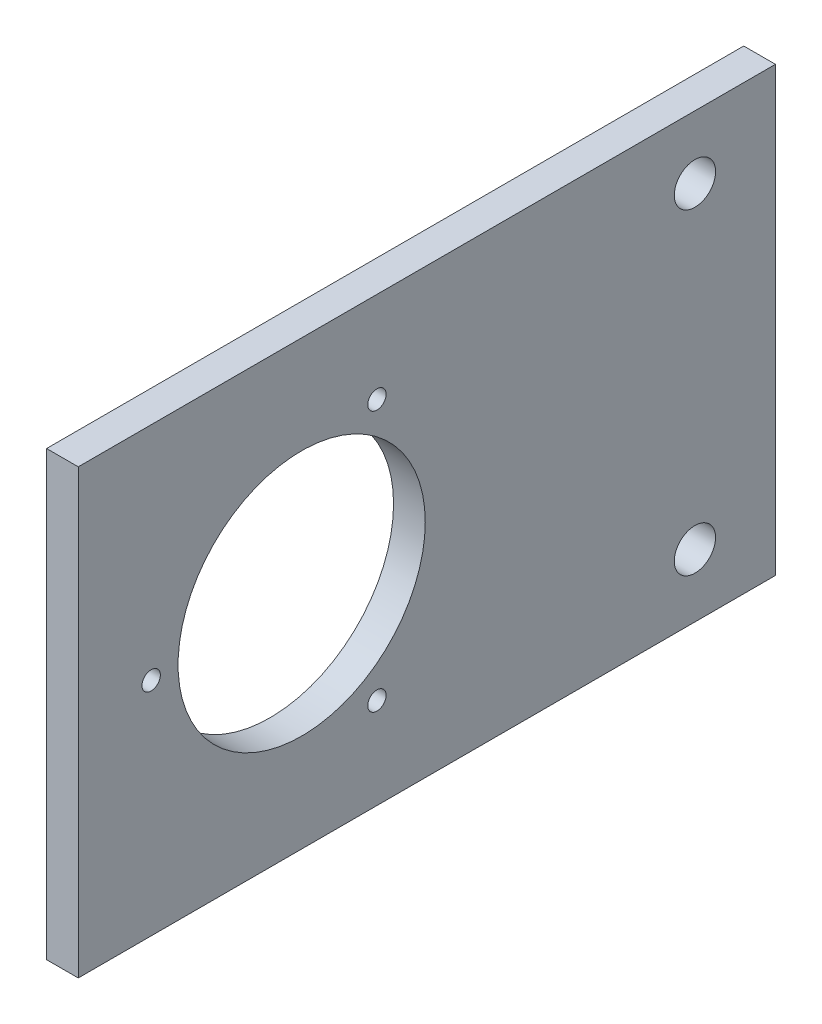
ISO-10303-21;
HEADER;
FILE_DESCRIPTION(('STEP AP214'),'2;1');
FILE_NAME('part.step','',(''),(''),'','','');
FILE_SCHEMA(('AUTOMOTIVE_DESIGN { 1 0 10303 214 1 1 1 1 }'));
ENDSEC;
DATA;
#1=APPLICATION_CONTEXT('core data for automotive mechanical design processes');
#2=APPLICATION_PROTOCOL_DEFINITION('international standard','automotive_design',2000,#1);
#3=PRODUCT_CONTEXT('',#1,'mechanical');
#4=PRODUCT('Part','Part','',(#3));
#5=PRODUCT_RELATED_PRODUCT_CATEGORY('part','',(#4));
#6=PRODUCT_DEFINITION_FORMATION('','',#4);
#7=PRODUCT_DEFINITION_CONTEXT('part definition',#1,'design');
#8=PRODUCT_DEFINITION('design','',#6,#7);
#9=PRODUCT_DEFINITION_SHAPE('','',#8);
#10=(LENGTH_UNIT() NAMED_UNIT(*) SI_UNIT(.MILLI.,.METRE.));
#11=(NAMED_UNIT(*) PLANE_ANGLE_UNIT() SI_UNIT($,.RADIAN.));
#12=(NAMED_UNIT(*) SI_UNIT($,.STERADIAN.) SOLID_ANGLE_UNIT());
#13=UNCERTAINTY_MEASURE_WITH_UNIT(LENGTH_MEASURE(1.E-05),#10,'distance_accuracy_value','');
#14=(GEOMETRIC_REPRESENTATION_CONTEXT(3) GLOBAL_UNCERTAINTY_ASSIGNED_CONTEXT((#13)) GLOBAL_UNIT_ASSIGNED_CONTEXT((#10,
#11,#12)) REPRESENTATION_CONTEXT('',''));
#15=CARTESIAN_POINT('',(0.,0.,0.));
#16=DIRECTION('',(0.,0.,1.));
#17=DIRECTION('',(1.,0.,0.));
#18=AXIS2_PLACEMENT_3D('',#15,#16,#17);
#19=CARTESIAN_POINT('',(5.,0.,0.));
#20=DIRECTION('',(-1.,0.,0.));
#21=DIRECTION('',(0.,0.,1.));
#22=AXIS2_PLACEMENT_3D('',#19,#20,#21);
#23=PLANE('',#22);
#24=DIRECTION('',(0.,0.,1.));
#25=VECTOR('',#24,1.);
#26=CARTESIAN_POINT('',(5.,34.925,-55.));
#27=LINE('',#26,#25);
#28=CARTESIAN_POINT('',(5.,34.925,-55.));
#29=VERTEX_POINT('',#28);
#30=CARTESIAN_POINT('',(5.,34.925,55.));
#31=VERTEX_POINT('',#30);
#32=EDGE_CURVE('E91',#29,#31,#27,.T.);
#33=ORIENTED_EDGE('',*,*,#32,.T.);
#34=DIRECTION('',(0.,-1.,0.));
#35=VECTOR('',#34,1.);
#36=CARTESIAN_POINT('',(5.,-34.925,55.));
#37=LINE('',#36,#35);
#38=CARTESIAN_POINT('',(5.,-34.925,55.));
#39=VERTEX_POINT('',#38);
#40=EDGE_CURVE('E86',#31,#39,#37,.T.);
#41=ORIENTED_EDGE('',*,*,#40,.T.);
#42=DIRECTION('',(0.,0.,-1.));
#43=VECTOR('',#42,1.);
#44=CARTESIAN_POINT('',(5.,-34.925,-55.));
#45=LINE('',#44,#43);
#46=CARTESIAN_POINT('',(5.,-34.925,-55.));
#47=VERTEX_POINT('',#46);
#48=EDGE_CURVE('E89',#39,#47,#45,.T.);
#49=ORIENTED_EDGE('',*,*,#48,.T.);
#50=DIRECTION('',(0.,1.,0.));
#51=VECTOR('',#50,1.);
#52=CARTESIAN_POINT('',(5.,-34.925,-55.));
#53=LINE('',#52,#51);
#54=EDGE_CURVE('E56',#47,#29,#53,.T.);
#55=ORIENTED_EDGE('',*,*,#54,.T.);
#56=EDGE_LOOP('',(#33,#41,#49,#55));
#57=FACE_BOUND('',#56,.T.);
#58=CARTESIAN_POINT('',(5.,-20.5681033398804,7.87500000000005));
#59=DIRECTION('',(1.,0.,0.));
#60=DIRECTION('',(0.,0.,-1.));
#61=AXIS2_PLACEMENT_3D('',#58,#59,#60);
#62=CIRCLE('',#61,1.45);
#63=CARTESIAN_POINT('',(5.,-20.5681033398804,6.42500000000005));
#64=VERTEX_POINT('',#63);
#65=EDGE_CURVE('E106',#64,#64,#62,.T.);
#66=ORIENTED_EDGE('',*,*,#65,.F.);
#67=EDGE_LOOP('',(#66));
#68=FACE_BOUND('',#67,.T.);
#69=CARTESIAN_POINT('',(5.,20.5681033398804,7.87499999999991));
#70=DIRECTION('',(1.,0.,0.));
#71=DIRECTION('',(0.,0.,-1.));
#72=AXIS2_PLACEMENT_3D('',#69,#70,#71);
#73=CIRCLE('',#72,1.45);
#74=CARTESIAN_POINT('',(5.,20.5681033398804,6.42499999999991));
#75=VERTEX_POINT('',#74);
#76=EDGE_CURVE('E121',#75,#75,#73,.T.);
#77=ORIENTED_EDGE('',*,*,#76,.F.);
#78=EDGE_LOOP('',(#77));
#79=FACE_BOUND('',#78,.T.);
#80=CARTESIAN_POINT('',(5.,0.,43.5));
#81=DIRECTION('',(1.,0.,0.));
#82=DIRECTION('',(0.,0.,-1.));
#83=AXIS2_PLACEMENT_3D('',#80,#81,#82);
#84=CIRCLE('',#83,1.45);
#85=CARTESIAN_POINT('',(5.,0.,42.05));
#86=VERTEX_POINT('',#85);
#87=EDGE_CURVE('E127',#86,#86,#84,.T.);
#88=ORIENTED_EDGE('',*,*,#87,.F.);
#89=EDGE_LOOP('',(#88));
#90=FACE_BOUND('',#89,.T.);
#91=CARTESIAN_POINT('',(5.,0.,19.75));
#92=DIRECTION('',(1.,0.,0.));
#93=DIRECTION('',(0.,0.,-1.));
#94=AXIS2_PLACEMENT_3D('',#91,#92,#93);
#95=CIRCLE('',#94,19.5);
#96=CARTESIAN_POINT('',(5.,0.,0.250000000000004));
#97=VERTEX_POINT('',#96);
#98=EDGE_CURVE('E133',#97,#97,#95,.T.);
#99=ORIENTED_EDGE('',*,*,#98,.F.);
#100=EDGE_LOOP('',(#99));
#101=FACE_BOUND('',#100,.T.);
#102=CARTESIAN_POINT('',(5.,-25.,-42.3));
#103=DIRECTION('',(1.,0.,0.));
#104=DIRECTION('',(0.,0.,-1.));
#105=AXIS2_PLACEMENT_3D('',#102,#103,#104);
#106=CIRCLE('',#105,3.25755);
#107=CARTESIAN_POINT('',(5.,-25.,-45.55755));
#108=VERTEX_POINT('',#107);
#109=EDGE_CURVE('E139',#108,#108,#106,.T.);
#110=ORIENTED_EDGE('',*,*,#109,.F.);
#111=EDGE_LOOP('',(#110));
#112=FACE_BOUND('',#111,.T.);
#113=CARTESIAN_POINT('',(5.,25.,-42.3));
#114=DIRECTION('',(1.,0.,0.));
#115=DIRECTION('',(0.,0.,1.));
#116=AXIS2_PLACEMENT_3D('',#113,#114,#115);
#117=CIRCLE('',#116,3.25755);
#118=CARTESIAN_POINT('',(5.,25.,-39.04245));
#119=VERTEX_POINT('',#118);
#120=EDGE_CURVE('E145',#119,#119,#117,.T.);
#121=ORIENTED_EDGE('',*,*,#120,.F.);
#122=EDGE_LOOP('',(#121));
#123=FACE_BOUND('',#122,.T.);
#124=ADVANCED_FACE('F39',(#57,#68,#79,#90,#101,#112,#123),#23,.F.);
#125=CARTESIAN_POINT('',(0.,0.,0.));
#126=DIRECTION('',(-1.,0.,0.));
#127=DIRECTION('',(0.,0.,1.));
#128=AXIS2_PLACEMENT_3D('',#125,#126,#127);
#129=PLANE('',#128);
#130=CARTESIAN_POINT('',(0.,-25.,-42.3));
#131=DIRECTION('',(1.,0.,0.));
#132=DIRECTION('',(0.,0.,-1.));
#133=AXIS2_PLACEMENT_3D('',#130,#131,#132);
#134=CIRCLE('',#133,3.25755);
#135=CARTESIAN_POINT('',(0.,-25.,-45.55755));
#136=VERTEX_POINT('',#135);
#137=EDGE_CURVE('E142',#136,#136,#134,.T.);
#138=ORIENTED_EDGE('',*,*,#137,.T.);
#139=EDGE_LOOP('',(#138));
#140=FACE_BOUND('',#139,.T.);
#141=CARTESIAN_POINT('',(0.,0.,43.5));
#142=DIRECTION('',(1.,0.,0.));
#143=DIRECTION('',(0.,0.,-1.));
#144=AXIS2_PLACEMENT_3D('',#141,#142,#143);
#145=CIRCLE('',#144,1.45);
#146=CARTESIAN_POINT('',(0.,0.,42.05));
#147=VERTEX_POINT('',#146);
#148=EDGE_CURVE('E130',#147,#147,#145,.T.);
#149=ORIENTED_EDGE('',*,*,#148,.T.);
#150=EDGE_LOOP('',(#149));
#151=FACE_BOUND('',#150,.T.);
#152=CARTESIAN_POINT('',(0.,-20.5681033398804,7.87500000000005));
#153=DIRECTION('',(1.,0.,0.));
#154=DIRECTION('',(0.,0.,-1.));
#155=AXIS2_PLACEMENT_3D('',#152,#153,#154);
#156=CIRCLE('',#155,1.45);
#157=CARTESIAN_POINT('',(0.,-20.5681033398804,6.42500000000005));
#158=VERTEX_POINT('',#157);
#159=EDGE_CURVE('E118',#158,#158,#156,.T.);
#160=ORIENTED_EDGE('',*,*,#159,.T.);
#161=EDGE_LOOP('',(#160));
#162=FACE_BOUND('',#161,.T.);
#163=DIRECTION('',(0.,0.,1.));
#164=VECTOR('',#163,1.);
#165=CARTESIAN_POINT('',(0.,34.925,-55.));
#166=LINE('',#165,#164);
#167=CARTESIAN_POINT('',(0.,34.925,-55.));
#168=VERTEX_POINT('',#167);
#169=CARTESIAN_POINT('',(0.,34.925,55.));
#170=VERTEX_POINT('',#169);
#171=EDGE_CURVE('E103',#168,#170,#166,.T.);
#172=ORIENTED_EDGE('',*,*,#171,.F.);
#173=DIRECTION('',(0.,1.,0.));
#174=VECTOR('',#173,1.);
#175=CARTESIAN_POINT('',(0.,-34.925,-55.));
#176=LINE('',#175,#174);
#177=CARTESIAN_POINT('',(0.,-34.925,-55.));
#178=VERTEX_POINT('',#177);
#179=EDGE_CURVE('E79',#178,#168,#176,.T.);
#180=ORIENTED_EDGE('',*,*,#179,.F.);
#181=DIRECTION('',(0.,0.,-1.));
#182=VECTOR('',#181,1.);
#183=CARTESIAN_POINT('',(0.,-34.925,-55.));
#184=LINE('',#183,#182);
#185=CARTESIAN_POINT('',(0.,-34.925,55.));
#186=VERTEX_POINT('',#185);
#187=EDGE_CURVE('E73',#186,#178,#184,.T.);
#188=ORIENTED_EDGE('',*,*,#187,.F.);
#189=DIRECTION('',(0.,-1.,0.));
#190=VECTOR('',#189,1.);
#191=CARTESIAN_POINT('',(0.,-34.925,55.));
#192=LINE('',#191,#190);
#193=EDGE_CURVE('E95',#170,#186,#192,.T.);
#194=ORIENTED_EDGE('',*,*,#193,.F.);
#195=EDGE_LOOP('',(#172,#180,#188,#194));
#196=FACE_BOUND('',#195,.T.);
#197=CARTESIAN_POINT('',(0.,20.5681033398804,7.87499999999991));
#198=DIRECTION('',(1.,0.,0.));
#199=DIRECTION('',(0.,0.,-1.));
#200=AXIS2_PLACEMENT_3D('',#197,#198,#199);
#201=CIRCLE('',#200,1.45);
#202=CARTESIAN_POINT('',(0.,20.5681033398804,6.42499999999991));
#203=VERTEX_POINT('',#202);
#204=EDGE_CURVE('E124',#203,#203,#201,.T.);
#205=ORIENTED_EDGE('',*,*,#204,.T.);
#206=EDGE_LOOP('',(#205));
#207=FACE_BOUND('',#206,.T.);
#208=CARTESIAN_POINT('',(0.,0.,19.75));
#209=DIRECTION('',(1.,0.,0.));
#210=DIRECTION('',(0.,0.,-1.));
#211=AXIS2_PLACEMENT_3D('',#208,#209,#210);
#212=CIRCLE('',#211,19.5);
#213=CARTESIAN_POINT('',(0.,0.,0.250000000000004));
#214=VERTEX_POINT('',#213);
#215=EDGE_CURVE('E136',#214,#214,#212,.T.);
#216=ORIENTED_EDGE('',*,*,#215,.T.);
#217=EDGE_LOOP('',(#216));
#218=FACE_BOUND('',#217,.T.);
#219=CARTESIAN_POINT('',(0.,25.,-42.3));
#220=DIRECTION('',(1.,0.,0.));
#221=DIRECTION('',(0.,0.,1.));
#222=AXIS2_PLACEMENT_3D('',#219,#220,#221);
#223=CIRCLE('',#222,3.25755);
#224=CARTESIAN_POINT('',(0.,25.,-39.04245));
#225=VERTEX_POINT('',#224);
#226=EDGE_CURVE('E148',#225,#225,#223,.T.);
#227=ORIENTED_EDGE('',*,*,#226,.T.);
#228=EDGE_LOOP('',(#227));
#229=FACE_BOUND('',#228,.T.);
#230=ADVANCED_FACE('F114',(#140,#151,#162,#196,#207,#218,#229),#129,.T.);
#231=CARTESIAN_POINT('',(5.,34.925,-55.));
#232=DIRECTION('',(0.,-1.,0.));
#233=DIRECTION('',(0.,0.,-1.));
#234=AXIS2_PLACEMENT_3D('',#231,#232,#233);
#235=PLANE('',#234);
#236=ORIENTED_EDGE('',*,*,#171,.T.);
#237=DIRECTION('',(-1.,0.,0.));
#238=VECTOR('',#237,1.);
#239=CARTESIAN_POINT('',(5.,34.925,55.));
#240=LINE('',#239,#238);
#241=EDGE_CURVE('E11',#31,#170,#240,.T.);
#242=ORIENTED_EDGE('',*,*,#241,.F.);
#243=ORIENTED_EDGE('',*,*,#32,.F.);
#244=DIRECTION('',(-1.,0.,0.));
#245=VECTOR('',#244,1.);
#246=CARTESIAN_POINT('',(5.,34.925,-55.));
#247=LINE('',#246,#245);
#248=EDGE_CURVE('E99',#29,#168,#247,.T.);
#249=ORIENTED_EDGE('',*,*,#248,.T.);
#250=EDGE_LOOP('',(#236,#242,#243,#249));
#251=FACE_BOUND('',#250,.T.);
#252=ADVANCED_FACE('F41',(#251),#235,.F.);
#253=CARTESIAN_POINT('',(5.,-34.925,55.));
#254=DIRECTION('',(0.,0.,-1.));
#255=DIRECTION('',(0.,1.,0.));
#256=AXIS2_PLACEMENT_3D('',#253,#254,#255);
#257=PLANE('',#256);
#258=ORIENTED_EDGE('',*,*,#193,.T.);
#259=DIRECTION('',(-1.,0.,0.));
#260=VECTOR('',#259,1.);
#261=CARTESIAN_POINT('',(5.,-34.925,55.));
#262=LINE('',#261,#260);
#263=EDGE_CURVE('E48',#39,#186,#262,.T.);
#264=ORIENTED_EDGE('',*,*,#263,.F.);
#265=ORIENTED_EDGE('',*,*,#40,.F.);
#266=ORIENTED_EDGE('',*,*,#241,.T.);
#267=EDGE_LOOP('',(#258,#264,#265,#266));
#268=FACE_BOUND('',#267,.T.);
#269=ADVANCED_FACE('F94',(#268),#257,.F.);
#270=CARTESIAN_POINT('',(5.,-34.925,-55.));
#271=DIRECTION('',(0.,1.,0.));
#272=DIRECTION('',(0.,0.,1.));
#273=AXIS2_PLACEMENT_3D('',#270,#271,#272);
#274=PLANE('',#273);
#275=ORIENTED_EDGE('',*,*,#187,.T.);
#276=DIRECTION('',(-1.,0.,0.));
#277=VECTOR('',#276,1.);
#278=CARTESIAN_POINT('',(5.,-34.925,-55.));
#279=LINE('',#278,#277);
#280=EDGE_CURVE('E96',#47,#178,#279,.T.);
#281=ORIENTED_EDGE('',*,*,#280,.F.);
#282=ORIENTED_EDGE('',*,*,#48,.F.);
#283=ORIENTED_EDGE('',*,*,#263,.T.);
#284=EDGE_LOOP('',(#275,#281,#282,#283));
#285=FACE_BOUND('',#284,.T.);
#286=ADVANCED_FACE('F97',(#285),#274,.F.);
#287=CARTESIAN_POINT('',(5.,-34.925,-55.));
#288=DIRECTION('',(0.,0.,1.));
#289=DIRECTION('',(0.,-1.,0.));
#290=AXIS2_PLACEMENT_3D('',#287,#288,#289);
#291=PLANE('',#290);
#292=ORIENTED_EDGE('',*,*,#179,.T.);
#293=ORIENTED_EDGE('',*,*,#248,.F.);
#294=ORIENTED_EDGE('',*,*,#54,.F.);
#295=ORIENTED_EDGE('',*,*,#280,.T.);
#296=EDGE_LOOP('',(#292,#293,#294,#295));
#297=FACE_BOUND('',#296,.T.);
#298=ADVANCED_FACE('F111',(#297),#291,.F.);
#299=CARTESIAN_POINT('',(5.,-20.5681033398804,7.87500000000005));
#300=DIRECTION('',(-1.,0.,0.));
#301=DIRECTION('',(0.,0.,1.));
#302=AXIS2_PLACEMENT_3D('',#299,#300,#301);
#303=CYLINDRICAL_SURFACE('',#302,1.45);
#304=ORIENTED_EDGE('',*,*,#65,.T.);
#305=EDGE_LOOP('',(#304));
#306=FACE_BOUND('',#305,.T.);
#307=ORIENTED_EDGE('',*,*,#159,.F.);
#308=EDGE_LOOP('',(#307));
#309=FACE_BOUND('',#308,.T.);
#310=ADVANCED_FACE('F165',(#306,#309),#303,.F.);
#311=CARTESIAN_POINT('',(5.,20.5681033398804,7.87499999999991));
#312=DIRECTION('',(-1.,0.,0.));
#313=DIRECTION('',(0.,0.,1.));
#314=AXIS2_PLACEMENT_3D('',#311,#312,#313);
#315=CYLINDRICAL_SURFACE('',#314,1.45);
#316=ORIENTED_EDGE('',*,*,#76,.T.);
#317=EDGE_LOOP('',(#316));
#318=FACE_BOUND('',#317,.T.);
#319=ORIENTED_EDGE('',*,*,#204,.F.);
#320=EDGE_LOOP('',(#319));
#321=FACE_BOUND('',#320,.T.);
#322=ADVANCED_FACE('F210',(#318,#321),#315,.F.);
#323=CARTESIAN_POINT('',(5.,0.,43.5));
#324=DIRECTION('',(-1.,0.,0.));
#325=DIRECTION('',(0.,0.,1.));
#326=AXIS2_PLACEMENT_3D('',#323,#324,#325);
#327=CYLINDRICAL_SURFACE('',#326,1.45);
#328=ORIENTED_EDGE('',*,*,#87,.T.);
#329=EDGE_LOOP('',(#328));
#330=FACE_BOUND('',#329,.T.);
#331=ORIENTED_EDGE('',*,*,#148,.F.);
#332=EDGE_LOOP('',(#331));
#333=FACE_BOUND('',#332,.T.);
#334=ADVANCED_FACE('F218',(#330,#333),#327,.F.);
#335=CARTESIAN_POINT('',(5.,0.,19.75));
#336=DIRECTION('',(-1.,0.,0.));
#337=DIRECTION('',(0.,0.,1.));
#338=AXIS2_PLACEMENT_3D('',#335,#336,#337);
#339=CYLINDRICAL_SURFACE('',#338,19.5);
#340=ORIENTED_EDGE('',*,*,#98,.T.);
#341=EDGE_LOOP('',(#340));
#342=FACE_BOUND('',#341,.T.);
#343=ORIENTED_EDGE('',*,*,#215,.F.);
#344=EDGE_LOOP('',(#343));
#345=FACE_BOUND('',#344,.T.);
#346=ADVANCED_FACE('F226',(#342,#345),#339,.F.);
#347=CARTESIAN_POINT('',(5.,-25.,-42.3));
#348=DIRECTION('',(-1.,0.,0.));
#349=DIRECTION('',(0.,0.,1.));
#350=AXIS2_PLACEMENT_3D('',#347,#348,#349);
#351=CYLINDRICAL_SURFACE('',#350,3.25755);
#352=ORIENTED_EDGE('',*,*,#109,.T.);
#353=EDGE_LOOP('',(#352));
#354=FACE_BOUND('',#353,.T.);
#355=ORIENTED_EDGE('',*,*,#137,.F.);
#356=EDGE_LOOP('',(#355));
#357=FACE_BOUND('',#356,.T.);
#358=ADVANCED_FACE('F235',(#354,#357),#351,.F.);
#359=CARTESIAN_POINT('',(5.,25.,-42.3));
#360=DIRECTION('',(-1.,0.,0.));
#361=DIRECTION('',(0.,0.,1.));
#362=AXIS2_PLACEMENT_3D('',#359,#360,#361);
#363=CYLINDRICAL_SURFACE('',#362,3.25755);
#364=ORIENTED_EDGE('',*,*,#120,.T.);
#365=EDGE_LOOP('',(#364));
#366=FACE_BOUND('',#365,.T.);
#367=ORIENTED_EDGE('',*,*,#226,.F.);
#368=EDGE_LOOP('',(#367));
#369=FACE_BOUND('',#368,.T.);
#370=ADVANCED_FACE('F154',(#366,#369),#363,.F.);
#371=CLOSED_SHELL('',(#124,#230,#252,#269,#286,#298,#310,#322,#334,#346,#358,#370));
#372=MANIFOLD_SOLID_BREP('B2',#371);
#373=ADVANCED_BREP_SHAPE_REPRESENTATION('',(#18,#372),#14);
#374=SHAPE_DEFINITION_REPRESENTATION(#9,#373);
ENDSEC;
END-ISO-10303-21;
